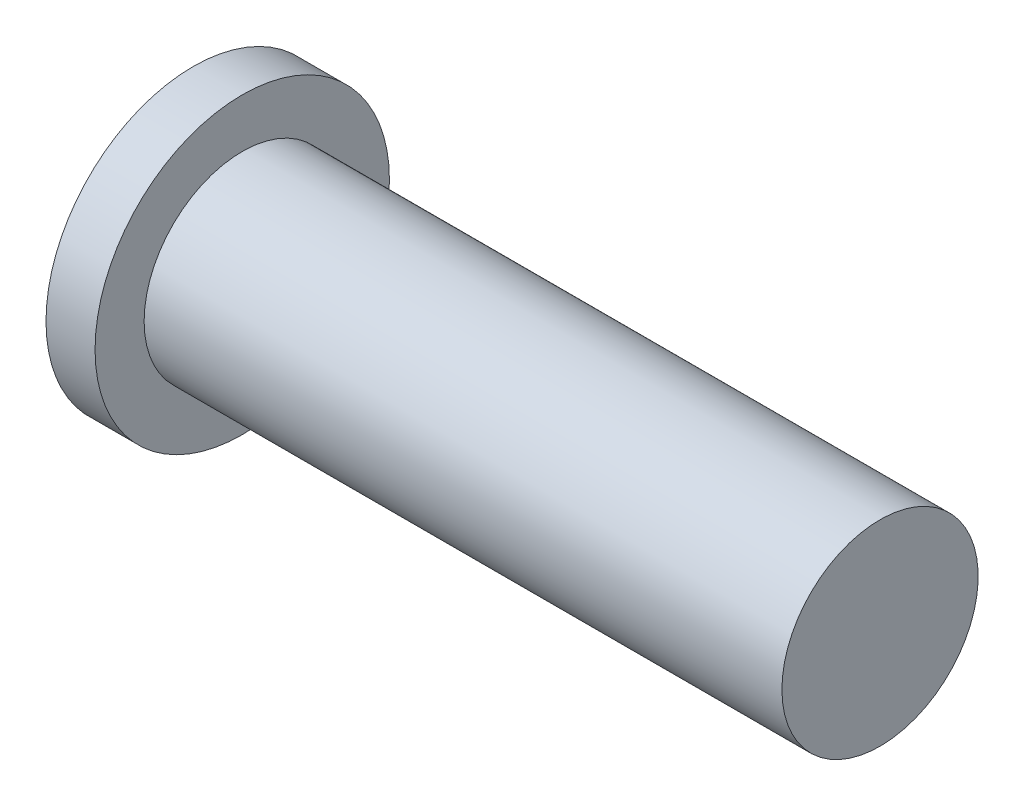
ISO-10303-21;
HEADER;
FILE_DESCRIPTION(('STEP AP214'),'2;1');
FILE_NAME('part.step','',(''),(''),'','','');
FILE_SCHEMA(('AUTOMOTIVE_DESIGN { 1 0 10303 214 1 1 1 1 }'));
ENDSEC;
DATA;
#1=APPLICATION_CONTEXT('core data for automotive mechanical design processes');
#2=APPLICATION_PROTOCOL_DEFINITION('international standard','automotive_design',2000,#1);
#3=PRODUCT_CONTEXT('',#1,'mechanical');
#4=PRODUCT('Part','Part','',(#3));
#5=PRODUCT_RELATED_PRODUCT_CATEGORY('part','',(#4));
#6=PRODUCT_DEFINITION_FORMATION('','',#4);
#7=PRODUCT_DEFINITION_CONTEXT('part definition',#1,'design');
#8=PRODUCT_DEFINITION('design','',#6,#7);
#9=PRODUCT_DEFINITION_SHAPE('','',#8);
#10=(LENGTH_UNIT() NAMED_UNIT(*) SI_UNIT(.MILLI.,.METRE.));
#11=(NAMED_UNIT(*) PLANE_ANGLE_UNIT() SI_UNIT($,.RADIAN.));
#12=(NAMED_UNIT(*) SI_UNIT($,.STERADIAN.) SOLID_ANGLE_UNIT());
#13=UNCERTAINTY_MEASURE_WITH_UNIT(LENGTH_MEASURE(1.E-05),#10,'distance_accuracy_value','');
#14=(GEOMETRIC_REPRESENTATION_CONTEXT(3) GLOBAL_UNCERTAINTY_ASSIGNED_CONTEXT((#13)) GLOBAL_UNIT_ASSIGNED_CONTEXT((#10,
#11,#12)) REPRESENTATION_CONTEXT('',''));
#15=CARTESIAN_POINT('',(0.,0.,0.));
#16=DIRECTION('',(0.,0.,1.));
#17=DIRECTION('',(1.,0.,0.));
#18=AXIS2_PLACEMENT_3D('',#15,#16,#17);
#19=CARTESIAN_POINT('',(-25.4,0.,0.));
#20=DIRECTION('',(-1.,0.,0.));
#21=DIRECTION('',(0.,0.,1.));
#22=AXIS2_PLACEMENT_3D('',#19,#20,#21);
#23=CYLINDRICAL_SURFACE('',#22,2.);
#24=CARTESIAN_POINT('',(16.1,0.,0.));
#25=DIRECTION('',(-1.,0.,0.));
#26=DIRECTION('',(0.,0.,1.));
#27=AXIS2_PLACEMENT_3D('',#24,#25,#26);
#28=CIRCLE('',#27,2.);
#29=CARTESIAN_POINT('',(16.1,0.,2.));
#30=VERTEX_POINT('',#29);
#31=EDGE_CURVE('E10',#30,#30,#28,.T.);
#32=ORIENTED_EDGE('',*,*,#31,.T.);
#33=EDGE_LOOP('',(#32));
#34=FACE_BOUND('',#33,.T.);
#35=CARTESIAN_POINT('',(3.1,0.,0.));
#36=DIRECTION('',(-1.,0.,0.));
#37=DIRECTION('',(0.,0.,1.));
#38=AXIS2_PLACEMENT_3D('',#35,#36,#37);
#39=CIRCLE('',#38,2.);
#40=CARTESIAN_POINT('',(3.1,0.,2.));
#41=VERTEX_POINT('',#40);
#42=EDGE_CURVE('E47',#41,#41,#39,.T.);
#43=ORIENTED_EDGE('',*,*,#42,.F.);
#44=EDGE_LOOP('',(#43));
#45=FACE_BOUND('',#44,.T.);
#46=ADVANCED_FACE('F33',(#34,#45),#23,.T.);
#47=CARTESIAN_POINT('',(16.1,2.,0.));
#48=DIRECTION('',(1.,0.,0.));
#49=DIRECTION('',(0.,0.,-1.));
#50=AXIS2_PLACEMENT_3D('',#47,#48,#49);
#51=PLANE('',#50);
#52=ORIENTED_EDGE('',*,*,#31,.F.);
#53=EDGE_LOOP('',(#52));
#54=FACE_BOUND('',#53,.T.);
#55=ADVANCED_FACE('F56',(#54),#51,.T.);
#56=CARTESIAN_POINT('',(2.1,3.,0.));
#57=DIRECTION('',(1.,0.,0.));
#58=DIRECTION('',(0.,0.,-1.));
#59=AXIS2_PLACEMENT_3D('',#56,#57,#58);
#60=PLANE('',#59);
#61=CARTESIAN_POINT('',(2.1,0.,0.));
#62=DIRECTION('',(-1.,0.,0.));
#63=DIRECTION('',(0.,0.,1.));
#64=AXIS2_PLACEMENT_3D('',#61,#62,#63);
#65=CIRCLE('',#64,3.);
#66=CARTESIAN_POINT('',(2.1,0.,3.));
#67=VERTEX_POINT('',#66);
#68=EDGE_CURVE('E39',#67,#67,#65,.T.);
#69=ORIENTED_EDGE('',*,*,#68,.T.);
#70=EDGE_LOOP('',(#69));
#71=FACE_BOUND('',#70,.T.);
#72=ADVANCED_FACE('F60',(#71),#60,.F.);
#73=CARTESIAN_POINT('',(-25.4,0.,0.));
#74=DIRECTION('',(-1.,0.,0.));
#75=DIRECTION('',(0.,0.,1.));
#76=AXIS2_PLACEMENT_3D('',#73,#74,#75);
#77=CYLINDRICAL_SURFACE('',#76,3.);
#78=ORIENTED_EDGE('',*,*,#68,.F.);
#79=EDGE_LOOP('',(#78));
#80=FACE_BOUND('',#79,.T.);
#81=CARTESIAN_POINT('',(3.1,0.,0.));
#82=DIRECTION('',(-1.,0.,0.));
#83=DIRECTION('',(0.,0.,1.));
#84=AXIS2_PLACEMENT_3D('',#81,#82,#83);
#85=CIRCLE('',#84,3.);
#86=CARTESIAN_POINT('',(3.1,0.,3.));
#87=VERTEX_POINT('',#86);
#88=EDGE_CURVE('E43',#87,#87,#85,.T.);
#89=ORIENTED_EDGE('',*,*,#88,.T.);
#90=EDGE_LOOP('',(#89));
#91=FACE_BOUND('',#90,.T.);
#92=ADVANCED_FACE('F65',(#80,#91),#77,.T.);
#93=CARTESIAN_POINT('',(3.1,2.,0.));
#94=DIRECTION('',(-1.,0.,0.));
#95=DIRECTION('',(0.,0.,1.));
#96=AXIS2_PLACEMENT_3D('',#93,#94,#95);
#97=PLANE('',#96);
#98=ORIENTED_EDGE('',*,*,#88,.F.);
#99=EDGE_LOOP('',(#98));
#100=FACE_BOUND('',#99,.T.);
#101=ORIENTED_EDGE('',*,*,#42,.T.);
#102=EDGE_LOOP('',(#101));
#103=FACE_BOUND('',#102,.T.);
#104=ADVANCED_FACE('F53',(#100,#103),#97,.F.);
#105=CLOSED_SHELL('',(#46,#55,#72,#92,#104));
#106=MANIFOLD_SOLID_BREP('B2',#105);
#107=ADVANCED_BREP_SHAPE_REPRESENTATION('',(#18,#106),#14);
#108=SHAPE_DEFINITION_REPRESENTATION(#9,#107);
ENDSEC;
END-ISO-10303-21;
